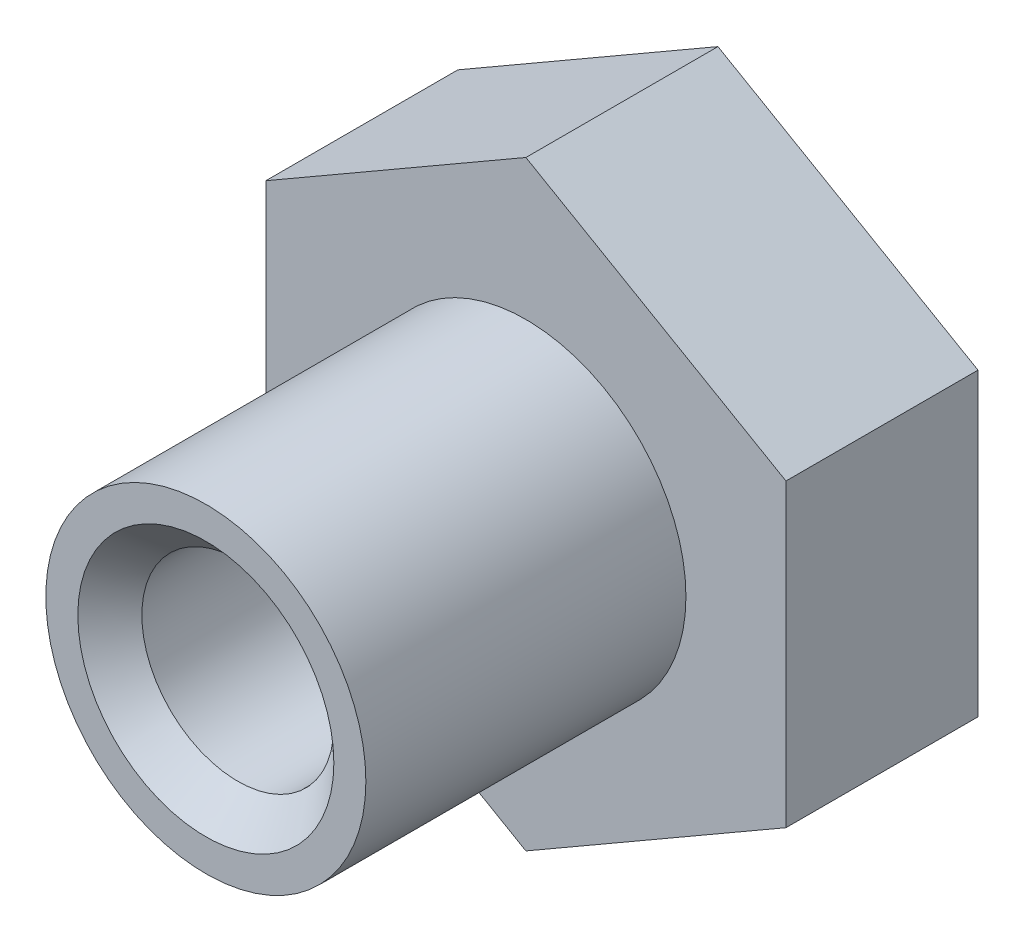
ISO-10303-21;
HEADER;
FILE_DESCRIPTION(('STEP AP214'),'2;1');
FILE_NAME('part.step','',(''),(''),'','','');
FILE_SCHEMA(('AUTOMOTIVE_DESIGN { 1 0 10303 214 1 1 1 1 }'));
ENDSEC;
DATA;
#1=APPLICATION_CONTEXT('core data for automotive mechanical design processes');
#2=APPLICATION_PROTOCOL_DEFINITION('international standard','automotive_design',2000,#1);
#3=PRODUCT_CONTEXT('',#1,'mechanical');
#4=PRODUCT('Part','Part','',(#3));
#5=PRODUCT_RELATED_PRODUCT_CATEGORY('part','',(#4));
#6=PRODUCT_DEFINITION_FORMATION('','',#4);
#7=PRODUCT_DEFINITION_CONTEXT('part definition',#1,'design');
#8=PRODUCT_DEFINITION('design','',#6,#7);
#9=PRODUCT_DEFINITION_SHAPE('','',#8);
#10=(LENGTH_UNIT() NAMED_UNIT(*) SI_UNIT(.MILLI.,.METRE.));
#11=(NAMED_UNIT(*) PLANE_ANGLE_UNIT() SI_UNIT($,.RADIAN.));
#12=(NAMED_UNIT(*) SI_UNIT($,.STERADIAN.) SOLID_ANGLE_UNIT());
#13=UNCERTAINTY_MEASURE_WITH_UNIT(LENGTH_MEASURE(1.E-05),#10,'distance_accuracy_value','');
#14=(GEOMETRIC_REPRESENTATION_CONTEXT(3) GLOBAL_UNCERTAINTY_ASSIGNED_CONTEXT((#13)) GLOBAL_UNIT_ASSIGNED_CONTEXT((#10,
#11,#12)) REPRESENTATION_CONTEXT('',''));
#15=CARTESIAN_POINT('',(0.,0.,0.));
#16=DIRECTION('',(0.,0.,1.));
#17=DIRECTION('',(1.,0.,0.));
#18=AXIS2_PLACEMENT_3D('',#15,#16,#17);
#19=CARTESIAN_POINT('',(10.31875,-5.95753309020045,7.62));
#20=DIRECTION('',(-1.,0.,0.));
#21=DIRECTION('',(0.,0.,1.));
#22=AXIS2_PLACEMENT_3D('',#19,#20,#21);
#23=PLANE('',#22);
#24=DIRECTION('',(0.,1.,0.));
#25=VECTOR('',#24,1.);
#26=CARTESIAN_POINT('',(10.31875,-5.95753309020045,0.));
#27=LINE('',#26,#25);
#28=CARTESIAN_POINT('',(10.31875,-5.95753309020045,0.));
#29=VERTEX_POINT('',#28);
#30=CARTESIAN_POINT('',(10.31875,5.95753309020045,0.));
#31=VERTEX_POINT('',#30);
#32=EDGE_CURVE('E122',#29,#31,#27,.T.);
#33=ORIENTED_EDGE('',*,*,#32,.T.);
#34=DIRECTION('',(0.,0.,-1.));
#35=VECTOR('',#34,1.);
#36=CARTESIAN_POINT('',(10.31875,5.95753309020045,7.62));
#37=LINE('',#36,#35);
#38=CARTESIAN_POINT('',(10.31875,5.95753309020045,7.62));
#39=VERTEX_POINT('',#38);
#40=EDGE_CURVE('E140',#39,#31,#37,.T.);
#41=ORIENTED_EDGE('',*,*,#40,.F.);
#42=DIRECTION('',(0.,1.,0.));
#43=VECTOR('',#42,1.);
#44=CARTESIAN_POINT('',(10.31875,-5.95753309020045,7.62));
#45=LINE('',#44,#43);
#46=CARTESIAN_POINT('',(10.31875,-5.95753309020045,7.62));
#47=VERTEX_POINT('',#46);
#48=EDGE_CURVE('E133',#47,#39,#45,.T.);
#49=ORIENTED_EDGE('',*,*,#48,.F.);
#50=DIRECTION('',(0.,0.,-1.));
#51=VECTOR('',#50,1.);
#52=CARTESIAN_POINT('',(10.31875,-5.95753309020045,7.62));
#53=LINE('',#52,#51);
#54=EDGE_CURVE('E118',#47,#29,#53,.T.);
#55=ORIENTED_EDGE('',*,*,#54,.T.);
#56=EDGE_LOOP('',(#33,#41,#49,#55));
#57=FACE_BOUND('',#56,.T.);
#58=ADVANCED_FACE('F35',(#57),#23,.F.);
#59=CARTESIAN_POINT('',(10.31875,5.95753309020045,7.62));
#60=DIRECTION('',(-0.5,-0.866025403784439,0.));
#61=DIRECTION('',(0.866025403784439,-0.5,0.));
#62=AXIS2_PLACEMENT_3D('',#59,#60,#61);
#63=PLANE('',#62);
#64=DIRECTION('',(-0.866025403784438,0.5,0.));
#65=VECTOR('',#64,1.);
#66=CARTESIAN_POINT('',(10.31875,5.95753309020045,0.));
#67=LINE('',#66,#65);
#68=CARTESIAN_POINT('',(0.,11.9150661804009,0.));
#69=VERTEX_POINT('',#68);
#70=EDGE_CURVE('E125',#31,#69,#67,.T.);
#71=ORIENTED_EDGE('',*,*,#70,.T.);
#72=DIRECTION('',(0.,0.,-1.));
#73=VECTOR('',#72,1.);
#74=CARTESIAN_POINT('',(0.,11.9150661804009,7.62));
#75=LINE('',#74,#73);
#76=CARTESIAN_POINT('',(0.,11.9150661804009,7.62));
#77=VERTEX_POINT('',#76);
#78=EDGE_CURVE('E137',#77,#69,#75,.T.);
#79=ORIENTED_EDGE('',*,*,#78,.F.);
#80=DIRECTION('',(-0.866025403784438,0.5,0.));
#81=VECTOR('',#80,1.);
#82=CARTESIAN_POINT('',(10.31875,5.95753309020045,7.62));
#83=LINE('',#82,#81);
#84=EDGE_CURVE('E91',#39,#77,#83,.T.);
#85=ORIENTED_EDGE('',*,*,#84,.F.);
#86=ORIENTED_EDGE('',*,*,#40,.T.);
#87=EDGE_LOOP('',(#71,#79,#85,#86));
#88=FACE_BOUND('',#87,.T.);
#89=ADVANCED_FACE('F180',(#88),#63,.F.);
#90=CARTESIAN_POINT('',(0.,11.9150661804009,7.62));
#91=DIRECTION('',(0.5,-0.866025403784439,0.));
#92=DIRECTION('',(0.866025403784439,0.5,0.));
#93=AXIS2_PLACEMENT_3D('',#90,#91,#92);
#94=PLANE('',#93);
#95=DIRECTION('',(-0.866025403784439,-0.5,0.));
#96=VECTOR('',#95,1.);
#97=CARTESIAN_POINT('',(0.,11.9150661804009,0.));
#98=LINE('',#97,#96);
#99=CARTESIAN_POINT('',(-10.31875,5.95753309020046,0.));
#100=VERTEX_POINT('',#99);
#101=EDGE_CURVE('E128',#69,#100,#98,.T.);
#102=ORIENTED_EDGE('',*,*,#101,.T.);
#103=DIRECTION('',(0.,0.,-1.));
#104=VECTOR('',#103,1.);
#105=CARTESIAN_POINT('',(-10.31875,5.95753309020046,7.62));
#106=LINE('',#105,#104);
#107=CARTESIAN_POINT('',(-10.31875,5.95753309020046,7.62));
#108=VERTEX_POINT('',#107);
#109=EDGE_CURVE('E113',#108,#100,#106,.T.);
#110=ORIENTED_EDGE('',*,*,#109,.F.);
#111=DIRECTION('',(-0.866025403784439,-0.5,0.));
#112=VECTOR('',#111,1.);
#113=CARTESIAN_POINT('',(0.,11.9150661804009,7.62));
#114=LINE('',#113,#112);
#115=EDGE_CURVE('E104',#77,#108,#114,.T.);
#116=ORIENTED_EDGE('',*,*,#115,.F.);
#117=ORIENTED_EDGE('',*,*,#78,.T.);
#118=EDGE_LOOP('',(#102,#110,#116,#117));
#119=FACE_BOUND('',#118,.T.);
#120=ADVANCED_FACE('F185',(#119),#94,.F.);
#121=CARTESIAN_POINT('',(-10.31875,5.95753309020046,7.62));
#122=DIRECTION('',(1.,0.,0.));
#123=DIRECTION('',(0.,0.,-1.));
#124=AXIS2_PLACEMENT_3D('',#121,#122,#123);
#125=PLANE('',#124);
#126=DIRECTION('',(0.,-1.,0.));
#127=VECTOR('',#126,1.);
#128=CARTESIAN_POINT('',(-10.31875,5.95753309020046,0.));
#129=LINE('',#128,#127);
#130=CARTESIAN_POINT('',(-10.31875,-5.95753309020045,0.));
#131=VERTEX_POINT('',#130);
#132=EDGE_CURVE('E112',#100,#131,#129,.T.);
#133=ORIENTED_EDGE('',*,*,#132,.T.);
#134=DIRECTION('',(0.,0.,-1.));
#135=VECTOR('',#134,1.);
#136=CARTESIAN_POINT('',(-10.31875,-5.95753309020045,7.62));
#137=LINE('',#136,#135);
#138=CARTESIAN_POINT('',(-10.31875,-5.95753309020045,7.62));
#139=VERTEX_POINT('',#138);
#140=EDGE_CURVE('E109',#139,#131,#137,.T.);
#141=ORIENTED_EDGE('',*,*,#140,.F.);
#142=DIRECTION('',(0.,-1.,0.));
#143=VECTOR('',#142,1.);
#144=CARTESIAN_POINT('',(-10.31875,5.95753309020046,7.62));
#145=LINE('',#144,#143);
#146=EDGE_CURVE('E98',#108,#139,#145,.T.);
#147=ORIENTED_EDGE('',*,*,#146,.F.);
#148=ORIENTED_EDGE('',*,*,#109,.T.);
#149=EDGE_LOOP('',(#133,#141,#147,#148));
#150=FACE_BOUND('',#149,.T.);
#151=ADVANCED_FACE('F110',(#150),#125,.F.);
#152=CARTESIAN_POINT('',(-10.31875,-5.95753309020045,7.62));
#153=DIRECTION('',(0.5,0.866025403784439,0.));
#154=DIRECTION('',(-0.866025403784439,0.5,0.));
#155=AXIS2_PLACEMENT_3D('',#152,#153,#154);
#156=PLANE('',#155);
#157=DIRECTION('',(0.866025403784439,-0.5,0.));
#158=VECTOR('',#157,1.);
#159=CARTESIAN_POINT('',(-10.31875,-5.95753309020045,0.));
#160=LINE('',#159,#158);
#161=CARTESIAN_POINT('',(0.,-11.9150661804009,0.));
#162=VERTEX_POINT('',#161);
#163=EDGE_CURVE('E76',#131,#162,#160,.T.);
#164=ORIENTED_EDGE('',*,*,#163,.T.);
#165=DIRECTION('',(0.,0.,-1.));
#166=VECTOR('',#165,1.);
#167=CARTESIAN_POINT('',(0.,-11.9150661804009,7.62));
#168=LINE('',#167,#166);
#169=CARTESIAN_POINT('',(0.,-11.9150661804009,7.62));
#170=VERTEX_POINT('',#169);
#171=EDGE_CURVE('E114',#170,#162,#168,.T.);
#172=ORIENTED_EDGE('',*,*,#171,.F.);
#173=DIRECTION('',(0.866025403784439,-0.5,0.));
#174=VECTOR('',#173,1.);
#175=CARTESIAN_POINT('',(-10.31875,-5.95753309020045,7.62));
#176=LINE('',#175,#174);
#177=EDGE_CURVE('E102',#139,#170,#176,.T.);
#178=ORIENTED_EDGE('',*,*,#177,.F.);
#179=ORIENTED_EDGE('',*,*,#140,.T.);
#180=EDGE_LOOP('',(#164,#172,#178,#179));
#181=FACE_BOUND('',#180,.T.);
#182=ADVANCED_FACE('F116',(#181),#156,.F.);
#183=CARTESIAN_POINT('',(0.,-11.9150661804009,7.62));
#184=DIRECTION('',(-0.5,0.866025403784439,0.));
#185=DIRECTION('',(-0.866025403784439,-0.5,0.));
#186=AXIS2_PLACEMENT_3D('',#183,#184,#185);
#187=PLANE('',#186);
#188=DIRECTION('',(0.866025403784439,0.5,0.));
#189=VECTOR('',#188,1.);
#190=CARTESIAN_POINT('',(0.,-11.9150661804009,0.));
#191=LINE('',#190,#189);
#192=EDGE_CURVE('E82',#162,#29,#191,.T.);
#193=ORIENTED_EDGE('',*,*,#192,.T.);
#194=ORIENTED_EDGE('',*,*,#54,.F.);
#195=DIRECTION('',(0.866025403784439,0.5,0.));
#196=VECTOR('',#195,1.);
#197=CARTESIAN_POINT('',(0.,-11.9150661804009,7.62));
#198=LINE('',#197,#196);
#199=EDGE_CURVE('E53',#170,#47,#198,.T.);
#200=ORIENTED_EDGE('',*,*,#199,.F.);
#201=ORIENTED_EDGE('',*,*,#171,.T.);
#202=EDGE_LOOP('',(#193,#194,#200,#201));
#203=FACE_BOUND('',#202,.T.);
#204=ADVANCED_FACE('F169',(#203),#187,.F.);
#205=CARTESIAN_POINT('',(0.,0.,7.62));
#206=DIRECTION('',(0.,0.,1.));
#207=DIRECTION('',(1.,0.,0.));
#208=AXIS2_PLACEMENT_3D('',#205,#206,#207);
#209=PLANE('',#208);
#210=CARTESIAN_POINT('',(0.,0.,7.62));
#211=DIRECTION('',(0.,0.,1.));
#212=DIRECTION('',(1.,0.,0.));
#213=AXIS2_PLACEMENT_3D('',#210,#211,#212);
#214=CIRCLE('',#213,6.35);
#215=CARTESIAN_POINT('',(6.35,0.,7.62));
#216=VERTEX_POINT('',#215);
#217=EDGE_CURVE('E142',#216,#216,#214,.T.);
#218=ORIENTED_EDGE('',*,*,#217,.F.);
#219=EDGE_LOOP('',(#218));
#220=FACE_BOUND('',#219,.T.);
#221=ORIENTED_EDGE('',*,*,#48,.T.);
#222=ORIENTED_EDGE('',*,*,#84,.T.);
#223=ORIENTED_EDGE('',*,*,#115,.T.);
#224=ORIENTED_EDGE('',*,*,#146,.T.);
#225=ORIENTED_EDGE('',*,*,#177,.T.);
#226=ORIENTED_EDGE('',*,*,#199,.T.);
#227=EDGE_LOOP('',(#221,#222,#223,#224,#225,#226));
#228=FACE_BOUND('',#227,.T.);
#229=ADVANCED_FACE('F100',(#220,#228),#209,.T.);
#230=CARTESIAN_POINT('',(0.,0.,0.));
#231=DIRECTION('',(0.,0.,1.));
#232=DIRECTION('',(1.,0.,0.));
#233=AXIS2_PLACEMENT_3D('',#230,#231,#232);
#234=PLANE('',#233);
#235=CARTESIAN_POINT('',(0.,0.,0.));
#236=DIRECTION('',(0.,0.,1.));
#237=DIRECTION('',(1.,0.,0.));
#238=AXIS2_PLACEMENT_3D('',#235,#236,#237);
#239=CIRCLE('',#238,5.08);
#240=CARTESIAN_POINT('',(5.08,0.,0.));
#241=VERTEX_POINT('',#240);
#242=EDGE_CURVE('E143',#241,#241,#239,.T.);
#243=ORIENTED_EDGE('',*,*,#242,.T.);
#244=EDGE_LOOP('',(#243));
#245=FACE_BOUND('',#244,.T.);
#246=ORIENTED_EDGE('',*,*,#32,.F.);
#247=ORIENTED_EDGE('',*,*,#192,.F.);
#248=ORIENTED_EDGE('',*,*,#163,.F.);
#249=ORIENTED_EDGE('',*,*,#132,.F.);
#250=ORIENTED_EDGE('',*,*,#101,.F.);
#251=ORIENTED_EDGE('',*,*,#70,.F.);
#252=EDGE_LOOP('',(#246,#247,#248,#249,#250,#251));
#253=FACE_BOUND('',#252,.T.);
#254=ADVANCED_FACE('F159',(#245,#253),#234,.F.);
#255=CARTESIAN_POINT('',(0.,0.,20.32));
#256=DIRECTION('',(0.,0.,-1.));
#257=DIRECTION('',(-1.,0.,0.));
#258=AXIS2_PLACEMENT_3D('',#255,#256,#257);
#259=CYLINDRICAL_SURFACE('',#258,6.35);
#260=CARTESIAN_POINT('',(0.,0.,20.32));
#261=DIRECTION('',(0.,0.,1.));
#262=DIRECTION('',(1.,0.,0.));
#263=AXIS2_PLACEMENT_3D('',#260,#261,#262);
#264=CIRCLE('',#263,6.35);
#265=CARTESIAN_POINT('',(6.35,0.,20.32));
#266=VERTEX_POINT('',#265);
#267=EDGE_CURVE('E126',#266,#266,#264,.T.);
#268=ORIENTED_EDGE('',*,*,#267,.F.);
#269=EDGE_LOOP('',(#268));
#270=FACE_BOUND('',#269,.T.);
#271=ORIENTED_EDGE('',*,*,#217,.T.);
#272=EDGE_LOOP('',(#271));
#273=FACE_BOUND('',#272,.T.);
#274=ADVANCED_FACE('F162',(#270,#273),#259,.T.);
#275=CARTESIAN_POINT('',(0.,0.,20.32));
#276=DIRECTION('',(0.,0.,1.));
#277=DIRECTION('',(1.,0.,0.));
#278=AXIS2_PLACEMENT_3D('',#275,#276,#277);
#279=PLANE('',#278);
#280=CARTESIAN_POINT('',(0.,0.,20.32));
#281=DIRECTION('',(0.,0.,1.));
#282=DIRECTION('',(1.,0.,0.));
#283=AXIS2_PLACEMENT_3D('',#280,#281,#282);
#284=CIRCLE('',#283,5.08000000000001);
#285=CARTESIAN_POINT('',(5.08000000000001,0.,20.32));
#286=VERTEX_POINT('',#285);
#287=EDGE_CURVE('E11',#286,#286,#284,.F.);
#288=ORIENTED_EDGE('',*,*,#287,.T.);
#289=EDGE_LOOP('',(#288));
#290=FACE_BOUND('',#289,.T.);
#291=ORIENTED_EDGE('',*,*,#267,.T.);
#292=EDGE_LOOP('',(#291));
#293=FACE_BOUND('',#292,.T.);
#294=ADVANCED_FACE('F225',(#290,#293),#279,.T.);
#295=CARTESIAN_POINT('',(0.,0.,0.));
#296=DIRECTION('',(0.,0.,1.));
#297=DIRECTION('',(1.,0.,0.));
#298=AXIS2_PLACEMENT_3D('',#295,#296,#297);
#299=CYLINDRICAL_SURFACE('',#298,3.81);
#300=CARTESIAN_POINT('',(0.,0.,1.27000000000001));
#301=DIRECTION('',(0.,0.,1.));
#302=DIRECTION('',(1.,0.,0.));
#303=AXIS2_PLACEMENT_3D('',#300,#301,#302);
#304=CIRCLE('',#303,3.81);
#305=CARTESIAN_POINT('',(3.81,0.,1.27000000000001));
#306=VERTEX_POINT('',#305);
#307=EDGE_CURVE('E45',#306,#306,#304,.F.);
#308=ORIENTED_EDGE('',*,*,#307,.T.);
#309=EDGE_LOOP('',(#308));
#310=FACE_BOUND('',#309,.T.);
#311=CARTESIAN_POINT('',(0.,0.,19.05));
#312=DIRECTION('',(0.,0.,1.));
#313=DIRECTION('',(1.,0.,0.));
#314=AXIS2_PLACEMENT_3D('',#311,#312,#313);
#315=CIRCLE('',#314,3.81);
#316=CARTESIAN_POINT('',(3.81,0.,19.05));
#317=VERTEX_POINT('',#316);
#318=EDGE_CURVE('E146',#317,#317,#315,.T.);
#319=ORIENTED_EDGE('',*,*,#318,.T.);
#320=EDGE_LOOP('',(#319));
#321=FACE_BOUND('',#320,.T.);
#322=ADVANCED_FACE('F151',(#310,#321),#299,.F.);
#323=CARTESIAN_POINT('',(0.,0.,0.));
#324=DIRECTION('',(0.,0.,-1.));
#325=DIRECTION('',(-1.,0.,0.));
#326=AXIS2_PLACEMENT_3D('',#323,#324,#325);
#327=CONICAL_SURFACE('',#326,5.08,0.785398163397447);
#328=ORIENTED_EDGE('',*,*,#307,.F.);
#329=EDGE_LOOP('',(#328));
#330=FACE_BOUND('',#329,.T.);
#331=ORIENTED_EDGE('',*,*,#242,.F.);
#332=EDGE_LOOP('',(#331));
#333=FACE_BOUND('',#332,.T.);
#334=ADVANCED_FACE('F154',(#330,#333),#327,.F.);
#335=CARTESIAN_POINT('',(0.,0.,19.05));
#336=DIRECTION('',(0.,0.,1.));
#337=DIRECTION('',(1.,0.,0.));
#338=AXIS2_PLACEMENT_3D('',#335,#336,#337);
#339=CONICAL_SURFACE('',#338,3.81,0.785398163397451);
#340=ORIENTED_EDGE('',*,*,#287,.F.);
#341=EDGE_LOOP('',(#340));
#342=FACE_BOUND('',#341,.T.);
#343=ORIENTED_EDGE('',*,*,#318,.F.);
#344=EDGE_LOOP('',(#343));
#345=FACE_BOUND('',#344,.T.);
#346=ADVANCED_FACE('F38',(#342,#345),#339,.F.);
#347=CLOSED_SHELL('',(#58,#89,#120,#151,#182,#204,#229,#254,#274,#294,#322,#334,#346));
#348=MANIFOLD_SOLID_BREP('B2',#347);
#349=ADVANCED_BREP_SHAPE_REPRESENTATION('',(#18,#348),#14);
#350=SHAPE_DEFINITION_REPRESENTATION(#9,#349);
ENDSEC;
END-ISO-10303-21;
